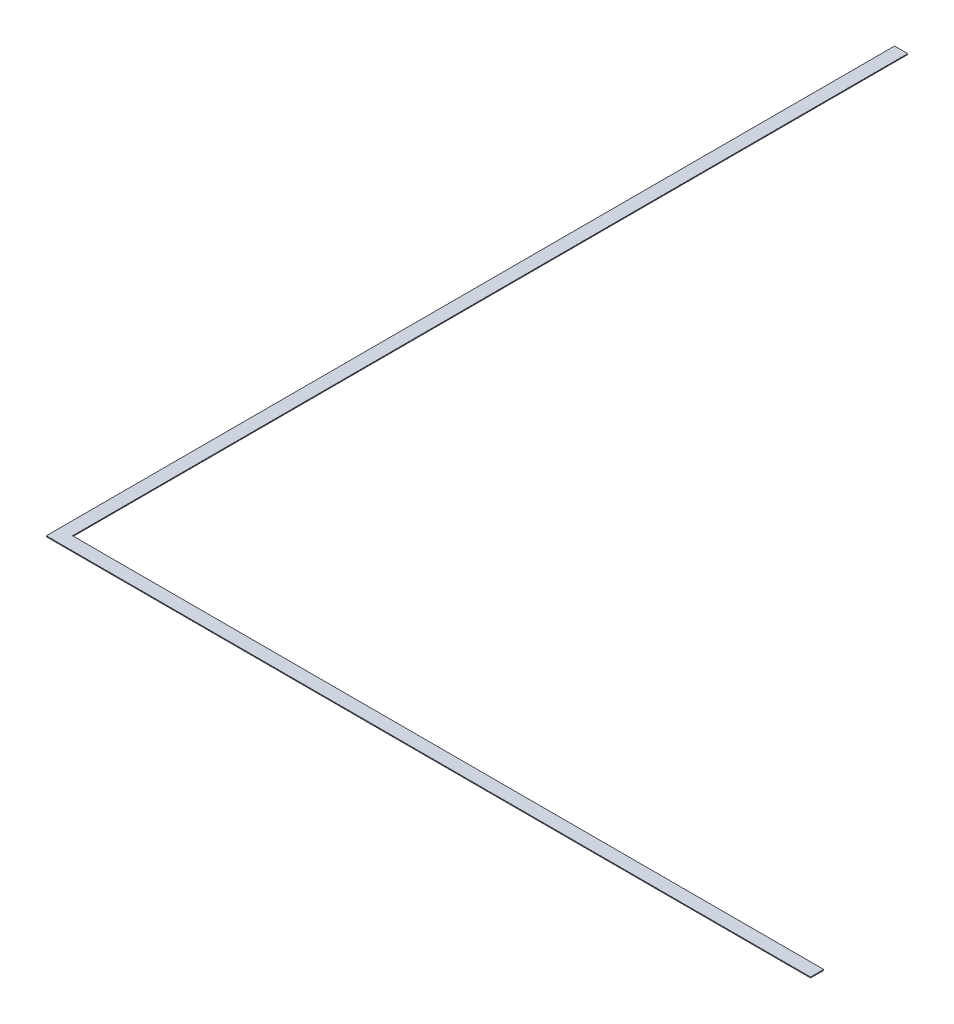
ISO-10303-21;
HEADER;
FILE_DESCRIPTION(('STEP AP214'),'2;1');
FILE_NAME('part.step','',(''),(''),'','','');
FILE_SCHEMA(('AUTOMOTIVE_DESIGN { 1 0 10303 214 1 1 1 1 }'));
ENDSEC;
DATA;
#1=APPLICATION_CONTEXT('core data for automotive mechanical design processes');
#2=APPLICATION_PROTOCOL_DEFINITION('international standard','automotive_design',2000,#1);
#3=PRODUCT_CONTEXT('',#1,'mechanical');
#4=PRODUCT('Part','Part','',(#3));
#5=PRODUCT_RELATED_PRODUCT_CATEGORY('part','',(#4));
#6=PRODUCT_DEFINITION_FORMATION('','',#4);
#7=PRODUCT_DEFINITION_CONTEXT('part definition',#1,'design');
#8=PRODUCT_DEFINITION('design','',#6,#7);
#9=PRODUCT_DEFINITION_SHAPE('','',#8);
#10=(LENGTH_UNIT() NAMED_UNIT(*) SI_UNIT(.MILLI.,.METRE.));
#11=(NAMED_UNIT(*) PLANE_ANGLE_UNIT() SI_UNIT($,.RADIAN.));
#12=(NAMED_UNIT(*) SI_UNIT($,.STERADIAN.) SOLID_ANGLE_UNIT());
#13=UNCERTAINTY_MEASURE_WITH_UNIT(LENGTH_MEASURE(1.E-05),#10,'distance_accuracy_value','');
#14=(GEOMETRIC_REPRESENTATION_CONTEXT(3) GLOBAL_UNCERTAINTY_ASSIGNED_CONTEXT((#13)) GLOBAL_UNIT_ASSIGNED_CONTEXT((#10,
#11,#12)) REPRESENTATION_CONTEXT('',''));
#15=CARTESIAN_POINT('',(0.,0.,0.));
#16=DIRECTION('',(0.,0.,1.));
#17=DIRECTION('',(1.,0.,0.));
#18=AXIS2_PLACEMENT_3D('',#15,#16,#17);
#19=CARTESIAN_POINT('',(-1.21491510808762E-13,3.175,1584.325));
#20=DIRECTION('',(0.,0.,-1.));
#21=DIRECTION('',(-1.,0.,0.));
#22=AXIS2_PLACEMENT_3D('',#19,#20,#21);
#23=PLANE('',#22);
#24=DIRECTION('',(1.,0.,0.));
#25=VECTOR('',#24,1.);
#26=CARTESIAN_POINT('',(-1.21491510808762E-13,0.,1584.325));
#27=LINE('',#26,#25);
#28=CARTESIAN_POINT('',(-1422.4,0.,1584.325));
#29=VERTEX_POINT('',#28);
#30=CARTESIAN_POINT('',(1473.2,0.,1584.325));
#31=VERTEX_POINT('',#30);
#32=EDGE_CURVE('E119',#29,#31,#27,.T.);
#33=ORIENTED_EDGE('',*,*,#32,.F.);
#34=DIRECTION('',(0.,-1.,0.));
#35=VECTOR('',#34,1.);
#36=CARTESIAN_POINT('',(-1422.4,3.175,1584.325));
#37=LINE('',#36,#35);
#38=CARTESIAN_POINT('',(-1422.4,3.175,1584.325));
#39=VERTEX_POINT('',#38);
#40=EDGE_CURVE('E11',#39,#29,#37,.T.);
#41=ORIENTED_EDGE('',*,*,#40,.F.);
#42=DIRECTION('',(1.,0.,0.));
#43=VECTOR('',#42,1.);
#44=CARTESIAN_POINT('',(-1.21491510808762E-13,3.175,1584.325));
#45=LINE('',#44,#43);
#46=CARTESIAN_POINT('',(1473.2,3.175,1584.325));
#47=VERTEX_POINT('',#46);
#48=EDGE_CURVE('E135',#39,#47,#45,.T.);
#49=ORIENTED_EDGE('',*,*,#48,.T.);
#50=DIRECTION('',(0.,-1.,0.));
#51=VECTOR('',#50,1.);
#52=CARTESIAN_POINT('',(1473.2,3.175,1584.325));
#53=LINE('',#52,#51);
#54=EDGE_CURVE('E52',#47,#31,#53,.T.);
#55=ORIENTED_EDGE('',*,*,#54,.T.);
#56=EDGE_LOOP('',(#33,#41,#49,#55));
#57=FACE_BOUND('',#56,.T.);
#58=ADVANCED_FACE('F36',(#57),#23,.T.);
#59=CARTESIAN_POINT('',(-1422.4,3.175,1.96205094687207E-13));
#60=DIRECTION('',(1.,0.,0.));
#61=DIRECTION('',(0.,0.,-1.));
#62=AXIS2_PLACEMENT_3D('',#59,#60,#61);
#63=PLANE('',#62);
#64=DIRECTION('',(0.,0.,1.));
#65=VECTOR('',#64,1.);
#66=CARTESIAN_POINT('',(-1422.4,0.,1.96205094687207E-13));
#67=LINE('',#66,#65);
#68=CARTESIAN_POINT('',(-1422.4,0.,-1635.125));
#69=VERTEX_POINT('',#68);
#70=EDGE_CURVE('E122',#69,#29,#67,.T.);
#71=ORIENTED_EDGE('',*,*,#70,.F.);
#72=DIRECTION('',(0.,-1.,0.));
#73=VECTOR('',#72,1.);
#74=CARTESIAN_POINT('',(-1422.4,3.175,-1635.125));
#75=LINE('',#74,#73);
#76=CARTESIAN_POINT('',(-1422.4,3.175,-1635.125));
#77=VERTEX_POINT('',#76);
#78=EDGE_CURVE('E44',#77,#69,#75,.T.);
#79=ORIENTED_EDGE('',*,*,#78,.F.);
#80=DIRECTION('',(0.,0.,1.));
#81=VECTOR('',#80,1.);
#82=CARTESIAN_POINT('',(-1422.4,3.175,1.96205094687207E-13));
#83=LINE('',#82,#81);
#84=EDGE_CURVE('E210',#77,#39,#83,.T.);
#85=ORIENTED_EDGE('',*,*,#84,.T.);
#86=ORIENTED_EDGE('',*,*,#40,.T.);
#87=EDGE_LOOP('',(#71,#79,#85,#86));
#88=FACE_BOUND('',#87,.T.);
#89=ADVANCED_FACE('F144',(#88),#63,.T.);
#90=CARTESIAN_POINT('',(0.,3.175,-1635.125));
#91=DIRECTION('',(0.,0.,-1.));
#92=DIRECTION('',(-1.,0.,0.));
#93=AXIS2_PLACEMENT_3D('',#90,#91,#92);
#94=PLANE('',#93);
#95=DIRECTION('',(1.,0.,0.));
#96=VECTOR('',#95,1.);
#97=CARTESIAN_POINT('',(0.,0.,-1635.125));
#98=LINE('',#97,#96);
#99=CARTESIAN_POINT('',(-1473.2,0.,-1635.125));
#100=VERTEX_POINT('',#99);
#101=EDGE_CURVE('E125',#100,#69,#98,.T.);
#102=ORIENTED_EDGE('',*,*,#101,.F.);
#103=DIRECTION('',(0.,-1.,0.));
#104=VECTOR('',#103,1.);
#105=CARTESIAN_POINT('',(-1473.2,3.175,-1635.125));
#106=LINE('',#105,#104);
#107=CARTESIAN_POINT('',(-1473.2,3.175,-1635.125));
#108=VERTEX_POINT('',#107);
#109=EDGE_CURVE('E109',#108,#100,#106,.T.);
#110=ORIENTED_EDGE('',*,*,#109,.F.);
#111=DIRECTION('',(1.,0.,0.));
#112=VECTOR('',#111,1.);
#113=CARTESIAN_POINT('',(0.,3.175,-1635.125));
#114=LINE('',#113,#112);
#115=EDGE_CURVE('E99',#108,#77,#114,.T.);
#116=ORIENTED_EDGE('',*,*,#115,.T.);
#117=ORIENTED_EDGE('',*,*,#78,.T.);
#118=EDGE_LOOP('',(#102,#110,#116,#117));
#119=FACE_BOUND('',#118,.T.);
#120=ADVANCED_FACE('F141',(#119),#94,.T.);
#121=CARTESIAN_POINT('',(-1473.2,3.175,2.00055721718863E-13));
#122=DIRECTION('',(1.,0.,0.));
#123=DIRECTION('',(0.,0.,-1.));
#124=AXIS2_PLACEMENT_3D('',#121,#122,#123);
#125=PLANE('',#124);
#126=DIRECTION('',(0.,0.,1.));
#127=VECTOR('',#126,1.);
#128=CARTESIAN_POINT('',(-1473.2,0.,2.00055721718863E-13));
#129=LINE('',#128,#127);
#130=CARTESIAN_POINT('',(-1473.2,0.,1635.125));
#131=VERTEX_POINT('',#130);
#132=EDGE_CURVE('E106',#100,#131,#129,.T.);
#133=ORIENTED_EDGE('',*,*,#132,.T.);
#134=DIRECTION('',(0.,-1.,0.));
#135=VECTOR('',#134,1.);
#136=CARTESIAN_POINT('',(-1473.2,3.175,1635.125));
#137=LINE('',#136,#135);
#138=CARTESIAN_POINT('',(-1473.2,3.175,1635.125));
#139=VERTEX_POINT('',#138);
#140=EDGE_CURVE('E103',#139,#131,#137,.T.);
#141=ORIENTED_EDGE('',*,*,#140,.F.);
#142=DIRECTION('',(0.,0.,1.));
#143=VECTOR('',#142,1.);
#144=CARTESIAN_POINT('',(-1473.2,3.175,2.00055721718863E-13));
#145=LINE('',#144,#143);
#146=EDGE_CURVE('E91',#108,#139,#145,.T.);
#147=ORIENTED_EDGE('',*,*,#146,.F.);
#148=ORIENTED_EDGE('',*,*,#109,.T.);
#149=EDGE_LOOP('',(#133,#141,#147,#148));
#150=FACE_BOUND('',#149,.T.);
#151=ADVANCED_FACE('F104',(#150),#125,.F.);
#152=CARTESIAN_POINT('',(0.,3.175,1635.125));
#153=DIRECTION('',(0.,0.,-1.));
#154=DIRECTION('',(-1.,0.,0.));
#155=AXIS2_PLACEMENT_3D('',#152,#153,#154);
#156=PLANE('',#155);
#157=DIRECTION('',(1.,0.,0.));
#158=VECTOR('',#157,1.);
#159=CARTESIAN_POINT('',(0.,0.,1635.125));
#160=LINE('',#159,#158);
#161=CARTESIAN_POINT('',(1473.2,0.,1635.125));
#162=VERTEX_POINT('',#161);
#163=EDGE_CURVE('E129',#131,#162,#160,.T.);
#164=ORIENTED_EDGE('',*,*,#163,.T.);
#165=DIRECTION('',(0.,-1.,0.));
#166=VECTOR('',#165,1.);
#167=CARTESIAN_POINT('',(1473.2,3.175,1635.125));
#168=LINE('',#167,#166);
#169=CARTESIAN_POINT('',(1473.2,3.175,1635.125));
#170=VERTEX_POINT('',#169);
#171=EDGE_CURVE('E72',#170,#162,#168,.T.);
#172=ORIENTED_EDGE('',*,*,#171,.F.);
#173=DIRECTION('',(1.,0.,0.));
#174=VECTOR('',#173,1.);
#175=CARTESIAN_POINT('',(0.,3.175,1635.125));
#176=LINE('',#175,#174);
#177=EDGE_CURVE('E96',#139,#170,#176,.T.);
#178=ORIENTED_EDGE('',*,*,#177,.F.);
#179=ORIENTED_EDGE('',*,*,#140,.T.);
#180=EDGE_LOOP('',(#164,#172,#178,#179));
#181=FACE_BOUND('',#180,.T.);
#182=ADVANCED_FACE('F111',(#181),#156,.F.);
#183=CARTESIAN_POINT('',(1473.2,3.175,-2.00055721718863E-13));
#184=DIRECTION('',(1.,0.,0.));
#185=DIRECTION('',(0.,0.,-1.));
#186=AXIS2_PLACEMENT_3D('',#183,#184,#185);
#187=PLANE('',#186);
#188=DIRECTION('',(0.,0.,1.));
#189=VECTOR('',#188,1.);
#190=CARTESIAN_POINT('',(1473.2,0.,-2.00055721718863E-13));
#191=LINE('',#190,#189);
#192=EDGE_CURVE('E132',#31,#162,#191,.T.);
#193=ORIENTED_EDGE('',*,*,#192,.F.);
#194=ORIENTED_EDGE('',*,*,#54,.F.);
#195=DIRECTION('',(0.,0.,1.));
#196=VECTOR('',#195,1.);
#197=CARTESIAN_POINT('',(1473.2,3.175,-2.00055721718863E-13));
#198=LINE('',#197,#196);
#199=EDGE_CURVE('E113',#47,#170,#198,.T.);
#200=ORIENTED_EDGE('',*,*,#199,.T.);
#201=ORIENTED_EDGE('',*,*,#171,.T.);
#202=EDGE_LOOP('',(#193,#194,#200,#201));
#203=FACE_BOUND('',#202,.T.);
#204=ADVANCED_FACE('F147',(#203),#187,.T.);
#205=CARTESIAN_POINT('',(0.,3.175,0.));
#206=DIRECTION('',(0.,1.,0.));
#207=DIRECTION('',(0.,0.,1.));
#208=AXIS2_PLACEMENT_3D('',#205,#206,#207);
#209=PLANE('',#208);
#210=ORIENTED_EDGE('',*,*,#48,.F.);
#211=ORIENTED_EDGE('',*,*,#84,.F.);
#212=ORIENTED_EDGE('',*,*,#115,.F.);
#213=ORIENTED_EDGE('',*,*,#146,.T.);
#214=ORIENTED_EDGE('',*,*,#177,.T.);
#215=ORIENTED_EDGE('',*,*,#199,.F.);
#216=EDGE_LOOP('',(#210,#211,#212,#213,#214,#215));
#217=FACE_BOUND('',#216,.T.);
#218=ADVANCED_FACE('F93',(#217),#209,.T.);
#219=CARTESIAN_POINT('',(0.,0.,0.));
#220=DIRECTION('',(0.,1.,0.));
#221=DIRECTION('',(0.,0.,1.));
#222=AXIS2_PLACEMENT_3D('',#219,#220,#221);
#223=PLANE('',#222);
#224=ORIENTED_EDGE('',*,*,#32,.T.);
#225=ORIENTED_EDGE('',*,*,#192,.T.);
#226=ORIENTED_EDGE('',*,*,#163,.F.);
#227=ORIENTED_EDGE('',*,*,#132,.F.);
#228=ORIENTED_EDGE('',*,*,#101,.T.);
#229=ORIENTED_EDGE('',*,*,#70,.T.);
#230=EDGE_LOOP('',(#224,#225,#226,#227,#228,#229));
#231=FACE_BOUND('',#230,.T.);
#232=ADVANCED_FACE('F146',(#231),#223,.F.);
#233=CLOSED_SHELL('',(#58,#89,#120,#151,#182,#204,#218,#232));
#234=MANIFOLD_SOLID_BREP('B2',#233);
#235=ADVANCED_BREP_SHAPE_REPRESENTATION('',(#18,#234),#14);
#236=SHAPE_DEFINITION_REPRESENTATION(#9,#235);
ENDSEC;
END-ISO-10303-21;
